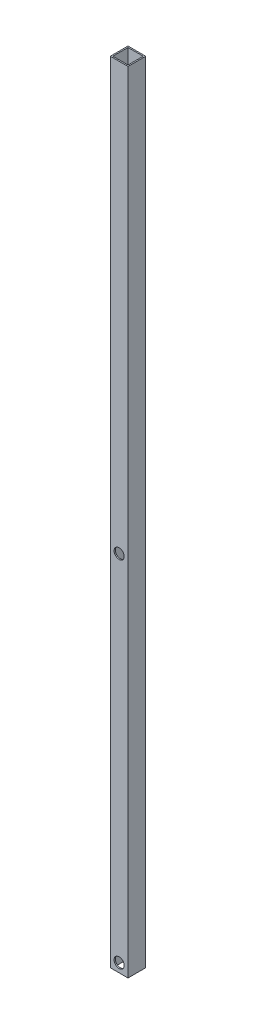
ISO-10303-21;
HEADER;
FILE_DESCRIPTION(('STEP AP214'),'2;1');
FILE_NAME('part.step','',(''),(''),'','','');
FILE_SCHEMA(('AUTOMOTIVE_DESIGN { 1 0 10303 214 1 1 1 1 }'));
ENDSEC;
DATA;
#1=APPLICATION_CONTEXT('core data for automotive mechanical design processes');
#2=APPLICATION_PROTOCOL_DEFINITION('international standard','automotive_design',2000,#1);
#3=PRODUCT_CONTEXT('',#1,'mechanical');
#4=PRODUCT('Part','Part','',(#3));
#5=PRODUCT_RELATED_PRODUCT_CATEGORY('part','',(#4));
#6=PRODUCT_DEFINITION_FORMATION('','',#4);
#7=PRODUCT_DEFINITION_CONTEXT('part definition',#1,'design');
#8=PRODUCT_DEFINITION('design','',#6,#7);
#9=PRODUCT_DEFINITION_SHAPE('','',#8);
#10=(LENGTH_UNIT() NAMED_UNIT(*) SI_UNIT(.MILLI.,.METRE.));
#11=(NAMED_UNIT(*) PLANE_ANGLE_UNIT() SI_UNIT($,.RADIAN.));
#12=(NAMED_UNIT(*) SI_UNIT($,.STERADIAN.) SOLID_ANGLE_UNIT());
#13=UNCERTAINTY_MEASURE_WITH_UNIT(LENGTH_MEASURE(1.E-05),#10,'distance_accuracy_value','');
#14=(GEOMETRIC_REPRESENTATION_CONTEXT(3) GLOBAL_UNCERTAINTY_ASSIGNED_CONTEXT((#13)) GLOBAL_UNIT_ASSIGNED_CONTEXT((#10,
#11,#12)) REPRESENTATION_CONTEXT('',''));
#15=CARTESIAN_POINT('',(0.,0.,0.));
#16=DIRECTION('',(0.,0.,1.));
#17=DIRECTION('',(1.,0.,0.));
#18=AXIS2_PLACEMENT_3D('',#15,#16,#17);
#19=CARTESIAN_POINT('',(0.,1981.2,0.));
#20=DIRECTION('',(0.,-1.,0.));
#21=DIRECTION('',(0.,0.,1.));
#22=AXIS2_PLACEMENT_3D('',#19,#20,#21);
#23=PLANE('',#22);
#24=DIRECTION('',(0.,0.,-1.));
#25=VECTOR('',#24,1.);
#26=CARTESIAN_POINT('',(0.,1981.2,0.));
#27=LINE('',#26,#25);
#28=CARTESIAN_POINT('',(0.,1981.2,44.45));
#29=VERTEX_POINT('',#28);
#30=CARTESIAN_POINT('',(0.,1981.2,0.));
#31=VERTEX_POINT('',#30);
#32=EDGE_CURVE('E160',#29,#31,#27,.T.);
#33=ORIENTED_EDGE('',*,*,#32,.F.);
#34=DIRECTION('',(-1.,0.,0.));
#35=VECTOR('',#34,1.);
#36=CARTESIAN_POINT('',(0.,1981.2,44.45));
#37=LINE('',#36,#35);
#38=CARTESIAN_POINT('',(44.45,1981.2,44.45));
#39=VERTEX_POINT('',#38);
#40=EDGE_CURVE('E173',#39,#29,#37,.T.);
#41=ORIENTED_EDGE('',*,*,#40,.F.);
#42=DIRECTION('',(0.,0.,1.));
#43=VECTOR('',#42,1.);
#44=CARTESIAN_POINT('',(44.45,1981.2,0.));
#45=LINE('',#44,#43);
#46=CARTESIAN_POINT('',(44.45,1981.2,0.));
#47=VERTEX_POINT('',#46);
#48=EDGE_CURVE('E169',#47,#39,#45,.T.);
#49=ORIENTED_EDGE('',*,*,#48,.F.);
#50=DIRECTION('',(1.,0.,0.));
#51=VECTOR('',#50,1.);
#52=CARTESIAN_POINT('',(0.,1981.2,0.));
#53=LINE('',#52,#51);
#54=EDGE_CURVE('E164',#31,#47,#53,.T.);
#55=ORIENTED_EDGE('',*,*,#54,.F.);
#56=EDGE_LOOP('',(#33,#41,#49,#55));
#57=FACE_BOUND('',#56,.T.);
#58=DIRECTION('',(1.,0.,0.));
#59=VECTOR('',#58,1.);
#60=CARTESIAN_POINT('',(3.175,1981.2,3.175));
#61=LINE('',#60,#59);
#62=CARTESIAN_POINT('',(3.175,1981.2,3.175));
#63=VERTEX_POINT('',#62);
#64=CARTESIAN_POINT('',(41.275,1981.2,3.175));
#65=VERTEX_POINT('',#64);
#66=EDGE_CURVE('E111',#63,#65,#61,.T.);
#67=ORIENTED_EDGE('',*,*,#66,.T.);
#68=DIRECTION('',(0.,0.,1.));
#69=VECTOR('',#68,1.);
#70=CARTESIAN_POINT('',(41.275,1981.2,3.175));
#71=LINE('',#70,#69);
#72=CARTESIAN_POINT('',(41.275,1981.2,41.275));
#73=VERTEX_POINT('',#72);
#74=EDGE_CURVE('E121',#65,#73,#71,.T.);
#75=ORIENTED_EDGE('',*,*,#74,.T.);
#76=DIRECTION('',(-1.,0.,0.));
#77=VECTOR('',#76,1.);
#78=CARTESIAN_POINT('',(3.175,1981.2,41.275));
#79=LINE('',#78,#77);
#80=CARTESIAN_POINT('',(3.175,1981.2,41.275));
#81=VERTEX_POINT('',#80);
#82=EDGE_CURVE('E126',#73,#81,#79,.T.);
#83=ORIENTED_EDGE('',*,*,#82,.T.);
#84=DIRECTION('',(0.,0.,-1.));
#85=VECTOR('',#84,1.);
#86=CARTESIAN_POINT('',(3.175,1981.2,3.175));
#87=LINE('',#86,#85);
#88=EDGE_CURVE('E129',#81,#63,#87,.T.);
#89=ORIENTED_EDGE('',*,*,#88,.T.);
#90=EDGE_LOOP('',(#67,#75,#83,#89));
#91=FACE_BOUND('',#90,.T.);
#92=ADVANCED_FACE('F43',(#57,#91),#23,.F.);
#93=CARTESIAN_POINT('',(0.,0.,0.));
#94=DIRECTION('',(0.,-1.,0.));
#95=DIRECTION('',(0.,0.,1.));
#96=AXIS2_PLACEMENT_3D('',#93,#94,#95);
#97=PLANE('',#96);
#98=DIRECTION('',(0.,0.,-1.));
#99=VECTOR('',#98,1.);
#100=CARTESIAN_POINT('',(0.,0.,0.));
#101=LINE('',#100,#99);
#102=CARTESIAN_POINT('',(0.,0.,44.45));
#103=VERTEX_POINT('',#102);
#104=CARTESIAN_POINT('',(0.,0.,0.));
#105=VERTEX_POINT('',#104);
#106=EDGE_CURVE('E117',#103,#105,#101,.T.);
#107=ORIENTED_EDGE('',*,*,#106,.T.);
#108=DIRECTION('',(1.,0.,0.));
#109=VECTOR('',#108,1.);
#110=CARTESIAN_POINT('',(0.,0.,0.));
#111=LINE('',#110,#109);
#112=CARTESIAN_POINT('',(44.45,0.,0.));
#113=VERTEX_POINT('',#112);
#114=EDGE_CURVE('E181',#105,#113,#111,.T.);
#115=ORIENTED_EDGE('',*,*,#114,.T.);
#116=DIRECTION('',(0.,0.,1.));
#117=VECTOR('',#116,1.);
#118=CARTESIAN_POINT('',(44.45,0.,0.));
#119=LINE('',#118,#117);
#120=CARTESIAN_POINT('',(44.45,0.,44.45));
#121=VERTEX_POINT('',#120);
#122=EDGE_CURVE('E185',#113,#121,#119,.T.);
#123=ORIENTED_EDGE('',*,*,#122,.T.);
#124=DIRECTION('',(-1.,0.,0.));
#125=VECTOR('',#124,1.);
#126=CARTESIAN_POINT('',(0.,0.,44.45));
#127=LINE('',#126,#125);
#128=EDGE_CURVE('E165',#121,#103,#127,.T.);
#129=ORIENTED_EDGE('',*,*,#128,.T.);
#130=EDGE_LOOP('',(#107,#115,#123,#129));
#131=FACE_BOUND('',#130,.T.);
#132=DIRECTION('',(0.,0.,-1.));
#133=VECTOR('',#132,1.);
#134=CARTESIAN_POINT('',(3.175,0.,3.175));
#135=LINE('',#134,#133);
#136=CARTESIAN_POINT('',(3.175,0.,41.275));
#137=VERTEX_POINT('',#136);
#138=CARTESIAN_POINT('',(3.175,0.,3.175));
#139=VERTEX_POINT('',#138);
#140=EDGE_CURVE('E131',#137,#139,#135,.T.);
#141=ORIENTED_EDGE('',*,*,#140,.F.);
#142=DIRECTION('',(-1.,0.,0.));
#143=VECTOR('',#142,1.);
#144=CARTESIAN_POINT('',(3.175,0.,41.275));
#145=LINE('',#144,#143);
#146=CARTESIAN_POINT('',(41.275,0.,41.275));
#147=VERTEX_POINT('',#146);
#148=EDGE_CURVE('E137',#147,#137,#145,.T.);
#149=ORIENTED_EDGE('',*,*,#148,.F.);
#150=DIRECTION('',(0.,0.,1.));
#151=VECTOR('',#150,1.);
#152=CARTESIAN_POINT('',(41.275,0.,3.175));
#153=LINE('',#152,#151);
#154=CARTESIAN_POINT('',(41.275,0.,3.175));
#155=VERTEX_POINT('',#154);
#156=EDGE_CURVE('E149',#155,#147,#153,.T.);
#157=ORIENTED_EDGE('',*,*,#156,.F.);
#158=DIRECTION('',(1.,0.,0.));
#159=VECTOR('',#158,1.);
#160=CARTESIAN_POINT('',(3.175,0.,3.175));
#161=LINE('',#160,#159);
#162=EDGE_CURVE('E112',#139,#155,#161,.T.);
#163=ORIENTED_EDGE('',*,*,#162,.F.);
#164=EDGE_LOOP('',(#141,#149,#157,#163));
#165=FACE_BOUND('',#164,.T.);
#166=ADVANCED_FACE('F206',(#131,#165),#97,.T.);
#167=CARTESIAN_POINT('',(0.,1981.2,0.));
#168=DIRECTION('',(1.,0.,0.));
#169=DIRECTION('',(0.,0.,1.));
#170=AXIS2_PLACEMENT_3D('',#167,#168,#169);
#171=PLANE('',#170);
#172=ORIENTED_EDGE('',*,*,#106,.F.);
#173=DIRECTION('',(0.,-1.,0.));
#174=VECTOR('',#173,1.);
#175=CARTESIAN_POINT('',(0.,1981.2,44.45));
#176=LINE('',#175,#174);
#177=EDGE_CURVE('E177',#29,#103,#176,.T.);
#178=ORIENTED_EDGE('',*,*,#177,.F.);
#179=ORIENTED_EDGE('',*,*,#32,.T.);
#180=DIRECTION('',(0.,-1.,0.));
#181=VECTOR('',#180,1.);
#182=CARTESIAN_POINT('',(0.,1981.2,0.));
#183=LINE('',#182,#181);
#184=EDGE_CURVE('E11',#31,#105,#183,.T.);
#185=ORIENTED_EDGE('',*,*,#184,.T.);
#186=EDGE_LOOP('',(#172,#178,#179,#185));
#187=FACE_BOUND('',#186,.T.);
#188=ADVANCED_FACE('F45',(#187),#171,.F.);
#189=CARTESIAN_POINT('',(0.,1981.2,0.));
#190=DIRECTION('',(0.,0.,1.));
#191=DIRECTION('',(-1.,0.,0.));
#192=AXIS2_PLACEMENT_3D('',#189,#190,#191);
#193=PLANE('',#192);
#194=CARTESIAN_POINT('',(22.225,22.225,0.));
#195=DIRECTION('',(0.,0.,1.));
#196=DIRECTION('',(1.,0.,0.));
#197=AXIS2_PLACEMENT_3D('',#194,#195,#196);
#198=CIRCLE('',#197,18.25625);
#199=CARTESIAN_POINT('',(40.48125,22.225,0.));
#200=VERTEX_POINT('',#199);
#201=EDGE_CURVE('E150',#200,#200,#198,.T.);
#202=ORIENTED_EDGE('',*,*,#201,.T.);
#203=EDGE_LOOP('',(#202));
#204=FACE_BOUND('',#203,.T.);
#205=CARTESIAN_POINT('',(22.225,911.225,0.));
#206=DIRECTION('',(0.,0.,1.));
#207=DIRECTION('',(1.,0.,0.));
#208=AXIS2_PLACEMENT_3D('',#205,#206,#207);
#209=CIRCLE('',#208,18.25625);
#210=CARTESIAN_POINT('',(40.48125,911.225,0.));
#211=VERTEX_POINT('',#210);
#212=EDGE_CURVE('E140',#211,#211,#209,.T.);
#213=ORIENTED_EDGE('',*,*,#212,.T.);
#214=EDGE_LOOP('',(#213));
#215=FACE_BOUND('',#214,.T.);
#216=ORIENTED_EDGE('',*,*,#114,.F.);
#217=ORIENTED_EDGE('',*,*,#184,.F.);
#218=ORIENTED_EDGE('',*,*,#54,.T.);
#219=DIRECTION('',(0.,-1.,0.));
#220=VECTOR('',#219,1.);
#221=CARTESIAN_POINT('',(44.45,1981.2,0.));
#222=LINE('',#221,#220);
#223=EDGE_CURVE('E52',#47,#113,#222,.T.);
#224=ORIENTED_EDGE('',*,*,#223,.T.);
#225=EDGE_LOOP('',(#216,#217,#218,#224));
#226=FACE_BOUND('',#225,.T.);
#227=ADVANCED_FACE('F199',(#204,#215,#226),#193,.F.);
#228=CARTESIAN_POINT('',(44.45,1981.2,0.));
#229=DIRECTION('',(-1.,0.,0.));
#230=DIRECTION('',(0.,0.,-1.));
#231=AXIS2_PLACEMENT_3D('',#228,#229,#230);
#232=PLANE('',#231);
#233=ORIENTED_EDGE('',*,*,#122,.F.);
#234=ORIENTED_EDGE('',*,*,#223,.F.);
#235=ORIENTED_EDGE('',*,*,#48,.T.);
#236=DIRECTION('',(0.,-1.,0.));
#237=VECTOR('',#236,1.);
#238=CARTESIAN_POINT('',(44.45,1981.2,44.45));
#239=LINE('',#238,#237);
#240=EDGE_CURVE('E194',#39,#121,#239,.T.);
#241=ORIENTED_EDGE('',*,*,#240,.T.);
#242=EDGE_LOOP('',(#233,#234,#235,#241));
#243=FACE_BOUND('',#242,.T.);
#244=ADVANCED_FACE('F203',(#243),#232,.F.);
#245=CARTESIAN_POINT('',(0.,1981.2,44.45));
#246=DIRECTION('',(0.,0.,-1.));
#247=DIRECTION('',(1.,0.,0.));
#248=AXIS2_PLACEMENT_3D('',#245,#246,#247);
#249=PLANE('',#248);
#250=CARTESIAN_POINT('',(22.225,911.225,44.45));
#251=DIRECTION('',(0.,0.,-1.));
#252=DIRECTION('',(-1.,0.,0.));
#253=AXIS2_PLACEMENT_3D('',#250,#251,#252);
#254=CIRCLE('',#253,12.7);
#255=CARTESIAN_POINT('',(9.525,911.225,44.45));
#256=VERTEX_POINT('',#255);
#257=EDGE_CURVE('E266',#256,#256,#254,.T.);
#258=ORIENTED_EDGE('',*,*,#257,.T.);
#259=EDGE_LOOP('',(#258));
#260=FACE_BOUND('',#259,.T.);
#261=CARTESIAN_POINT('',(22.225,22.225,44.45));
#262=DIRECTION('',(0.,0.,-1.));
#263=DIRECTION('',(-1.,0.,0.));
#264=AXIS2_PLACEMENT_3D('',#261,#262,#263);
#265=CIRCLE('',#264,12.7);
#266=CARTESIAN_POINT('',(9.525,22.225,44.45));
#267=VERTEX_POINT('',#266);
#268=EDGE_CURVE('E273',#267,#267,#265,.T.);
#269=ORIENTED_EDGE('',*,*,#268,.T.);
#270=EDGE_LOOP('',(#269));
#271=FACE_BOUND('',#270,.T.);
#272=ORIENTED_EDGE('',*,*,#128,.F.);
#273=ORIENTED_EDGE('',*,*,#240,.F.);
#274=ORIENTED_EDGE('',*,*,#40,.T.);
#275=ORIENTED_EDGE('',*,*,#177,.T.);
#276=EDGE_LOOP('',(#272,#273,#274,#275));
#277=FACE_BOUND('',#276,.T.);
#278=ADVANCED_FACE('F214',(#260,#271,#277),#249,.F.);
#279=CARTESIAN_POINT('',(3.175,1981.2,3.175));
#280=DIRECTION('',(0.,0.,1.));
#281=DIRECTION('',(-1.,0.,0.));
#282=AXIS2_PLACEMENT_3D('',#279,#280,#281);
#283=PLANE('',#282);
#284=CARTESIAN_POINT('',(22.225,22.225,3.175));
#285=DIRECTION('',(0.,0.,-1.));
#286=DIRECTION('',(-1.,0.,0.));
#287=AXIS2_PLACEMENT_3D('',#284,#285,#286);
#288=CIRCLE('',#287,18.25625);
#289=CARTESIAN_POINT('',(3.96875,22.225,3.175));
#290=VERTEX_POINT('',#289);
#291=EDGE_CURVE('E283',#290,#290,#288,.F.);
#292=ORIENTED_EDGE('',*,*,#291,.F.);
#293=EDGE_LOOP('',(#292));
#294=FACE_BOUND('',#293,.T.);
#295=CARTESIAN_POINT('',(22.225,911.225,3.175));
#296=DIRECTION('',(0.,0.,-1.));
#297=DIRECTION('',(-1.,0.,0.));
#298=AXIS2_PLACEMENT_3D('',#295,#296,#297);
#299=CIRCLE('',#298,18.25625);
#300=CARTESIAN_POINT('',(3.96875,911.225,3.175));
#301=VERTEX_POINT('',#300);
#302=EDGE_CURVE('E268',#301,#301,#299,.F.);
#303=ORIENTED_EDGE('',*,*,#302,.F.);
#304=EDGE_LOOP('',(#303));
#305=FACE_BOUND('',#304,.T.);
#306=ORIENTED_EDGE('',*,*,#162,.T.);
#307=DIRECTION('',(0.,-1.,0.));
#308=VECTOR('',#307,1.);
#309=CARTESIAN_POINT('',(41.275,1981.2,3.175));
#310=LINE('',#309,#308);
#311=EDGE_CURVE('E107',#65,#155,#310,.T.);
#312=ORIENTED_EDGE('',*,*,#311,.F.);
#313=ORIENTED_EDGE('',*,*,#66,.F.);
#314=DIRECTION('',(0.,-1.,0.));
#315=VECTOR('',#314,1.);
#316=CARTESIAN_POINT('',(3.175,1981.2,3.175));
#317=LINE('',#316,#315);
#318=EDGE_CURVE('E67',#63,#139,#317,.T.);
#319=ORIENTED_EDGE('',*,*,#318,.T.);
#320=EDGE_LOOP('',(#306,#312,#313,#319));
#321=FACE_BOUND('',#320,.T.);
#322=ADVANCED_FACE('F109',(#294,#305,#321),#283,.T.);
#323=CARTESIAN_POINT('',(41.275,1981.2,3.175));
#324=DIRECTION('',(-1.,0.,0.));
#325=DIRECTION('',(0.,0.,-1.));
#326=AXIS2_PLACEMENT_3D('',#323,#324,#325);
#327=PLANE('',#326);
#328=ORIENTED_EDGE('',*,*,#156,.T.);
#329=DIRECTION('',(0.,-1.,0.));
#330=VECTOR('',#329,1.);
#331=CARTESIAN_POINT('',(41.275,1981.2,41.275));
#332=LINE('',#331,#330);
#333=EDGE_CURVE('E118',#73,#147,#332,.T.);
#334=ORIENTED_EDGE('',*,*,#333,.F.);
#335=ORIENTED_EDGE('',*,*,#74,.F.);
#336=ORIENTED_EDGE('',*,*,#311,.T.);
#337=EDGE_LOOP('',(#328,#334,#335,#336));
#338=FACE_BOUND('',#337,.T.);
#339=ADVANCED_FACE('F122',(#338),#327,.T.);
#340=CARTESIAN_POINT('',(3.175,1981.2,41.275));
#341=DIRECTION('',(0.,0.,-1.));
#342=DIRECTION('',(1.,0.,0.));
#343=AXIS2_PLACEMENT_3D('',#340,#341,#342);
#344=PLANE('',#343);
#345=CARTESIAN_POINT('',(22.225,911.225,41.275));
#346=DIRECTION('',(0.,0.,1.));
#347=DIRECTION('',(1.,0.,0.));
#348=AXIS2_PLACEMENT_3D('',#345,#346,#347);
#349=CIRCLE('',#348,12.7);
#350=CARTESIAN_POINT('',(34.925,911.225,41.275));
#351=VERTEX_POINT('',#350);
#352=EDGE_CURVE('E264',#351,#351,#349,.F.);
#353=ORIENTED_EDGE('',*,*,#352,.F.);
#354=EDGE_LOOP('',(#353));
#355=FACE_BOUND('',#354,.T.);
#356=CARTESIAN_POINT('',(22.225,22.225,41.275));
#357=DIRECTION('',(0.,0.,1.));
#358=DIRECTION('',(1.,0.,0.));
#359=AXIS2_PLACEMENT_3D('',#356,#357,#358);
#360=CIRCLE('',#359,12.7);
#361=CARTESIAN_POINT('',(34.925,22.225,41.275));
#362=VERTEX_POINT('',#361);
#363=EDGE_CURVE('E279',#362,#362,#360,.F.);
#364=ORIENTED_EDGE('',*,*,#363,.F.);
#365=EDGE_LOOP('',(#364));
#366=FACE_BOUND('',#365,.T.);
#367=ORIENTED_EDGE('',*,*,#148,.T.);
#368=DIRECTION('',(0.,-1.,0.));
#369=VECTOR('',#368,1.);
#370=CARTESIAN_POINT('',(3.175,1981.2,41.275));
#371=LINE('',#370,#369);
#372=EDGE_CURVE('E59',#81,#137,#371,.T.);
#373=ORIENTED_EDGE('',*,*,#372,.F.);
#374=ORIENTED_EDGE('',*,*,#82,.F.);
#375=ORIENTED_EDGE('',*,*,#333,.T.);
#376=EDGE_LOOP('',(#367,#373,#374,#375));
#377=FACE_BOUND('',#376,.T.);
#378=ADVANCED_FACE('F236',(#355,#366,#377),#344,.T.);
#379=CARTESIAN_POINT('',(3.175,1981.2,3.175));
#380=DIRECTION('',(1.,0.,0.));
#381=DIRECTION('',(0.,0.,1.));
#382=AXIS2_PLACEMENT_3D('',#379,#380,#381);
#383=PLANE('',#382);
#384=ORIENTED_EDGE('',*,*,#140,.T.);
#385=ORIENTED_EDGE('',*,*,#318,.F.);
#386=ORIENTED_EDGE('',*,*,#88,.F.);
#387=ORIENTED_EDGE('',*,*,#372,.T.);
#388=EDGE_LOOP('',(#384,#385,#386,#387));
#389=FACE_BOUND('',#388,.T.);
#390=ADVANCED_FACE('F239',(#389),#383,.T.);
#391=CARTESIAN_POINT('',(22.225,911.225,44.451));
#392=DIRECTION('',(0.,0.,-1.));
#393=DIRECTION('',(1.,0.,0.));
#394=AXIS2_PLACEMENT_3D('',#391,#392,#393);
#395=CYLINDRICAL_SURFACE('',#394,18.25625);
#396=ORIENTED_EDGE('',*,*,#302,.T.);
#397=EDGE_LOOP('',(#396));
#398=FACE_BOUND('',#397,.T.);
#399=ORIENTED_EDGE('',*,*,#212,.F.);
#400=EDGE_LOOP('',(#399));
#401=FACE_BOUND('',#400,.T.);
#402=ADVANCED_FACE('F243',(#398,#401),#395,.F.);
#403=CARTESIAN_POINT('',(22.225,22.225,44.451));
#404=DIRECTION('',(0.,0.,-1.));
#405=DIRECTION('',(1.,0.,0.));
#406=AXIS2_PLACEMENT_3D('',#403,#404,#405);
#407=CYLINDRICAL_SURFACE('',#406,18.25625);
#408=ORIENTED_EDGE('',*,*,#291,.T.);
#409=EDGE_LOOP('',(#408));
#410=FACE_BOUND('',#409,.T.);
#411=ORIENTED_EDGE('',*,*,#201,.F.);
#412=EDGE_LOOP('',(#411));
#413=FACE_BOUND('',#412,.T.);
#414=ADVANCED_FACE('F247',(#410,#413),#407,.F.);
#415=CARTESIAN_POINT('',(22.225,22.225,-0.001000000000001));
#416=DIRECTION('',(0.,0.,1.));
#417=DIRECTION('',(-1.,0.,0.));
#418=AXIS2_PLACEMENT_3D('',#415,#416,#417);
#419=CYLINDRICAL_SURFACE('',#418,12.7);
#420=ORIENTED_EDGE('',*,*,#363,.T.);
#421=EDGE_LOOP('',(#420));
#422=FACE_BOUND('',#421,.T.);
#423=ORIENTED_EDGE('',*,*,#268,.F.);
#424=EDGE_LOOP('',(#423));
#425=FACE_BOUND('',#424,.T.);
#426=ADVANCED_FACE('F251',(#422,#425),#419,.F.);
#427=CARTESIAN_POINT('',(22.225,911.225,-0.001000000000001));
#428=DIRECTION('',(0.,0.,1.));
#429=DIRECTION('',(-1.,0.,0.));
#430=AXIS2_PLACEMENT_3D('',#427,#428,#429);
#431=CYLINDRICAL_SURFACE('',#430,12.7);
#432=ORIENTED_EDGE('',*,*,#352,.T.);
#433=EDGE_LOOP('',(#432));
#434=FACE_BOUND('',#433,.T.);
#435=ORIENTED_EDGE('',*,*,#257,.F.);
#436=EDGE_LOOP('',(#435));
#437=FACE_BOUND('',#436,.T.);
#438=ADVANCED_FACE('F255',(#434,#437),#431,.F.);
#439=CLOSED_SHELL('',(#92,#166,#188,#227,#244,#278,#322,#339,#378,#390,#402,#414,#426,#438));
#440=MANIFOLD_SOLID_BREP('B2',#439);
#441=ADVANCED_BREP_SHAPE_REPRESENTATION('',(#18,#440),#14);
#442=SHAPE_DEFINITION_REPRESENTATION(#9,#441);
ENDSEC;
END-ISO-10303-21;
